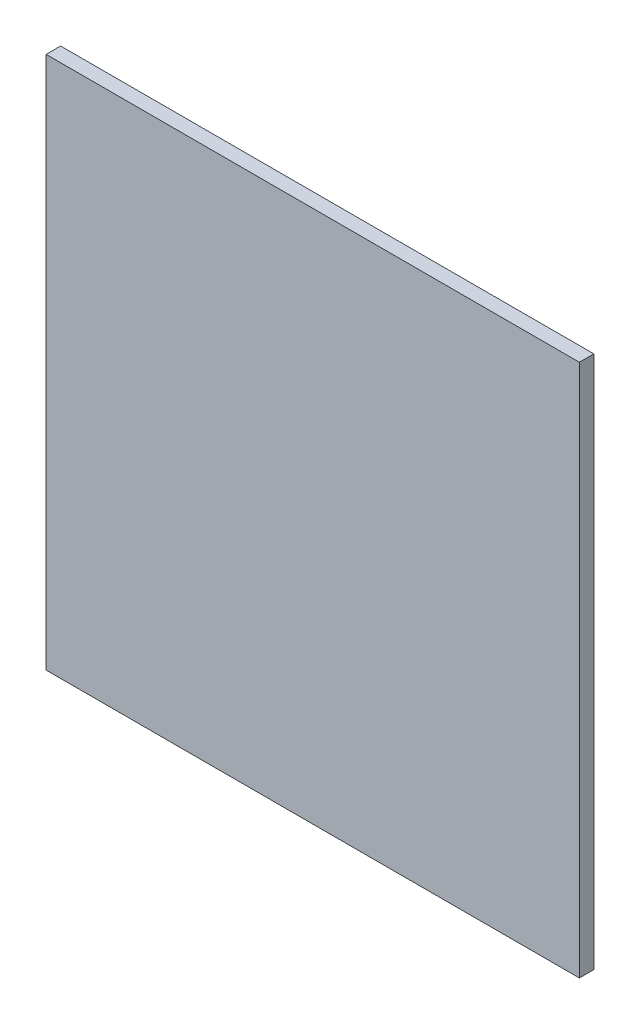
ISO-10303-21;
HEADER;
FILE_DESCRIPTION(('STEP AP214'),'2;1');
FILE_NAME('part.step','',(''),(''),'','','');
FILE_SCHEMA(('AUTOMOTIVE_DESIGN { 1 0 10303 214 1 1 1 1 }'));
ENDSEC;
DATA;
#1=APPLICATION_CONTEXT('core data for automotive mechanical design processes');
#2=APPLICATION_PROTOCOL_DEFINITION('international standard','automotive_design',2000,#1);
#3=PRODUCT_CONTEXT('',#1,'mechanical');
#4=PRODUCT('Part','Part','',(#3));
#5=PRODUCT_RELATED_PRODUCT_CATEGORY('part','',(#4));
#6=PRODUCT_DEFINITION_FORMATION('','',#4);
#7=PRODUCT_DEFINITION_CONTEXT('part definition',#1,'design');
#8=PRODUCT_DEFINITION('design','',#6,#7);
#9=PRODUCT_DEFINITION_SHAPE('','',#8);
#10=(LENGTH_UNIT() NAMED_UNIT(*) SI_UNIT(.MILLI.,.METRE.));
#11=(NAMED_UNIT(*) PLANE_ANGLE_UNIT() SI_UNIT($,.RADIAN.));
#12=(NAMED_UNIT(*) SI_UNIT($,.STERADIAN.) SOLID_ANGLE_UNIT());
#13=UNCERTAINTY_MEASURE_WITH_UNIT(LENGTH_MEASURE(1.E-05),#10,'distance_accuracy_value','');
#14=(GEOMETRIC_REPRESENTATION_CONTEXT(3) GLOBAL_UNCERTAINTY_ASSIGNED_CONTEXT((#13)) GLOBAL_UNIT_ASSIGNED_CONTEXT((#10,
#11,#12)) REPRESENTATION_CONTEXT('',''));
#15=CARTESIAN_POINT('',(0.,0.,0.));
#16=DIRECTION('',(0.,0.,1.));
#17=DIRECTION('',(1.,0.,0.));
#18=AXIS2_PLACEMENT_3D('',#15,#16,#17);
#19=CARTESIAN_POINT('',(-1.84,-1.84,0.));
#20=DIRECTION('',(1.,0.,0.));
#21=DIRECTION('',(0.,0.,1.));
#22=AXIS2_PLACEMENT_3D('',#19,#20,#21);
#23=PLANE('',#22);
#24=DIRECTION('',(0.,1.,0.));
#25=VECTOR('',#24,1.);
#26=CARTESIAN_POINT('',(-1.84,-1.84,0.1));
#27=LINE('',#26,#25);
#28=CARTESIAN_POINT('',(-1.84,-1.84,0.1));
#29=VERTEX_POINT('',#28);
#30=CARTESIAN_POINT('',(-1.84,1.84,0.1));
#31=VERTEX_POINT('',#30);
#32=EDGE_CURVE('E11',#29,#31,#27,.T.);
#33=ORIENTED_EDGE('',*,*,#32,.T.);
#34=DIRECTION('',(0.,0.,1.));
#35=VECTOR('',#34,1.);
#36=CARTESIAN_POINT('',(-1.84,1.84,0.));
#37=LINE('',#36,#35);
#38=CARTESIAN_POINT('',(-1.84,1.84,0.));
#39=VERTEX_POINT('',#38);
#40=EDGE_CURVE('E24',#39,#31,#37,.T.);
#41=ORIENTED_EDGE('',*,*,#40,.F.);
#42=DIRECTION('',(0.,1.,0.));
#43=VECTOR('',#42,1.);
#44=CARTESIAN_POINT('',(-1.84,-1.84,0.));
#45=LINE('',#44,#43);
#46=CARTESIAN_POINT('',(-1.84,-1.84,0.));
#47=VERTEX_POINT('',#46);
#48=EDGE_CURVE('E86',#47,#39,#45,.T.);
#49=ORIENTED_EDGE('',*,*,#48,.F.);
#50=DIRECTION('',(0.,0.,1.));
#51=VECTOR('',#50,1.);
#52=CARTESIAN_POINT('',(-1.84,-1.84,0.));
#53=LINE('',#52,#51);
#54=EDGE_CURVE('E36',#47,#29,#53,.T.);
#55=ORIENTED_EDGE('',*,*,#54,.T.);
#56=EDGE_LOOP('',(#33,#41,#49,#55));
#57=FACE_BOUND('',#56,.T.);
#58=ADVANCED_FACE('F17',(#57),#23,.F.);
#59=CARTESIAN_POINT('',(1.84,-1.84,0.));
#60=DIRECTION('',(1.,0.,0.));
#61=DIRECTION('',(0.,0.,1.));
#62=AXIS2_PLACEMENT_3D('',#59,#60,#61);
#63=PLANE('',#62);
#64=DIRECTION('',(0.,0.,1.));
#65=VECTOR('',#64,1.);
#66=CARTESIAN_POINT('',(1.84,-1.84,0.));
#67=LINE('',#66,#65);
#68=CARTESIAN_POINT('',(1.84,-1.84,0.));
#69=VERTEX_POINT('',#68);
#70=CARTESIAN_POINT('',(1.84,-1.84,0.1));
#71=VERTEX_POINT('',#70);
#72=EDGE_CURVE('E83',#69,#71,#67,.T.);
#73=ORIENTED_EDGE('',*,*,#72,.F.);
#74=DIRECTION('',(0.,1.,0.));
#75=VECTOR('',#74,1.);
#76=CARTESIAN_POINT('',(1.84,-1.84,0.));
#77=LINE('',#76,#75);
#78=CARTESIAN_POINT('',(1.84,1.84,0.));
#79=VERTEX_POINT('',#78);
#80=EDGE_CURVE('E63',#69,#79,#77,.T.);
#81=ORIENTED_EDGE('',*,*,#80,.T.);
#82=DIRECTION('',(0.,0.,1.));
#83=VECTOR('',#82,1.);
#84=CARTESIAN_POINT('',(1.84,1.84,0.));
#85=LINE('',#84,#83);
#86=CARTESIAN_POINT('',(1.84,1.84,0.1));
#87=VERTEX_POINT('',#86);
#88=EDGE_CURVE('E57',#79,#87,#85,.T.);
#89=ORIENTED_EDGE('',*,*,#88,.T.);
#90=DIRECTION('',(0.,1.,0.));
#91=VECTOR('',#90,1.);
#92=CARTESIAN_POINT('',(1.84,-1.84,0.1));
#93=LINE('',#92,#91);
#94=EDGE_CURVE('E60',#71,#87,#93,.T.);
#95=ORIENTED_EDGE('',*,*,#94,.F.);
#96=EDGE_LOOP('',(#73,#81,#89,#95));
#97=FACE_BOUND('',#96,.T.);
#98=ADVANCED_FACE('F59',(#97),#63,.T.);
#99=CARTESIAN_POINT('',(-1.84,-1.84,0.));
#100=DIRECTION('',(0.,1.,0.));
#101=DIRECTION('',(0.,0.,1.));
#102=AXIS2_PLACEMENT_3D('',#99,#100,#101);
#103=PLANE('',#102);
#104=ORIENTED_EDGE('',*,*,#72,.T.);
#105=DIRECTION('',(1.,0.,0.));
#106=VECTOR('',#105,1.);
#107=CARTESIAN_POINT('',(-1.84,-1.84,0.1));
#108=LINE('',#107,#106);
#109=EDGE_CURVE('E71',#29,#71,#108,.T.);
#110=ORIENTED_EDGE('',*,*,#109,.F.);
#111=ORIENTED_EDGE('',*,*,#54,.F.);
#112=DIRECTION('',(1.,0.,0.));
#113=VECTOR('',#112,1.);
#114=CARTESIAN_POINT('',(-1.84,-1.84,0.));
#115=LINE('',#114,#113);
#116=EDGE_CURVE('E76',#47,#69,#115,.T.);
#117=ORIENTED_EDGE('',*,*,#116,.T.);
#118=EDGE_LOOP('',(#104,#110,#111,#117));
#119=FACE_BOUND('',#118,.T.);
#120=ADVANCED_FACE('F91',(#119),#103,.F.);
#121=CARTESIAN_POINT('',(-1.84,1.84,0.));
#122=DIRECTION('',(0.,1.,0.));
#123=DIRECTION('',(0.,0.,1.));
#124=AXIS2_PLACEMENT_3D('',#121,#122,#123);
#125=PLANE('',#124);
#126=DIRECTION('',(1.,0.,0.));
#127=VECTOR('',#126,1.);
#128=CARTESIAN_POINT('',(-1.84,1.84,0.));
#129=LINE('',#128,#127);
#130=EDGE_CURVE('E74',#39,#79,#129,.T.);
#131=ORIENTED_EDGE('',*,*,#130,.F.);
#132=ORIENTED_EDGE('',*,*,#40,.T.);
#133=DIRECTION('',(1.,0.,0.));
#134=VECTOR('',#133,1.);
#135=CARTESIAN_POINT('',(-1.84,1.84,0.1));
#136=LINE('',#135,#134);
#137=EDGE_CURVE('E69',#31,#87,#136,.T.);
#138=ORIENTED_EDGE('',*,*,#137,.T.);
#139=ORIENTED_EDGE('',*,*,#88,.F.);
#140=EDGE_LOOP('',(#131,#132,#138,#139));
#141=FACE_BOUND('',#140,.T.);
#142=ADVANCED_FACE('F73',(#141),#125,.T.);
#143=CARTESIAN_POINT('',(-1.84,-1.84,0.));
#144=DIRECTION('',(0.,0.,1.));
#145=DIRECTION('',(1.,0.,0.));
#146=AXIS2_PLACEMENT_3D('',#143,#144,#145);
#147=PLANE('',#146);
#148=ORIENTED_EDGE('',*,*,#130,.T.);
#149=ORIENTED_EDGE('',*,*,#80,.F.);
#150=ORIENTED_EDGE('',*,*,#116,.F.);
#151=ORIENTED_EDGE('',*,*,#48,.T.);
#152=EDGE_LOOP('',(#148,#149,#150,#151));
#153=FACE_BOUND('',#152,.T.);
#154=ADVANCED_FACE('F89',(#153),#147,.F.);
#155=CARTESIAN_POINT('',(-1.84,-1.84,0.1));
#156=DIRECTION('',(0.,0.,1.));
#157=DIRECTION('',(1.,0.,0.));
#158=AXIS2_PLACEMENT_3D('',#155,#156,#157);
#159=PLANE('',#158);
#160=ORIENTED_EDGE('',*,*,#32,.F.);
#161=ORIENTED_EDGE('',*,*,#109,.T.);
#162=ORIENTED_EDGE('',*,*,#94,.T.);
#163=ORIENTED_EDGE('',*,*,#137,.F.);
#164=EDGE_LOOP('',(#160,#161,#162,#163));
#165=FACE_BOUND('',#164,.T.);
#166=ADVANCED_FACE('F68',(#165),#159,.T.);
#167=CLOSED_SHELL('',(#58,#98,#120,#142,#154,#166));
#168=MANIFOLD_SOLID_BREP('B1',#167);
#169=ADVANCED_BREP_SHAPE_REPRESENTATION('',(#18,#168),#14);
#170=SHAPE_DEFINITION_REPRESENTATION(#9,#169);
ENDSEC;
END-ISO-10303-21;
